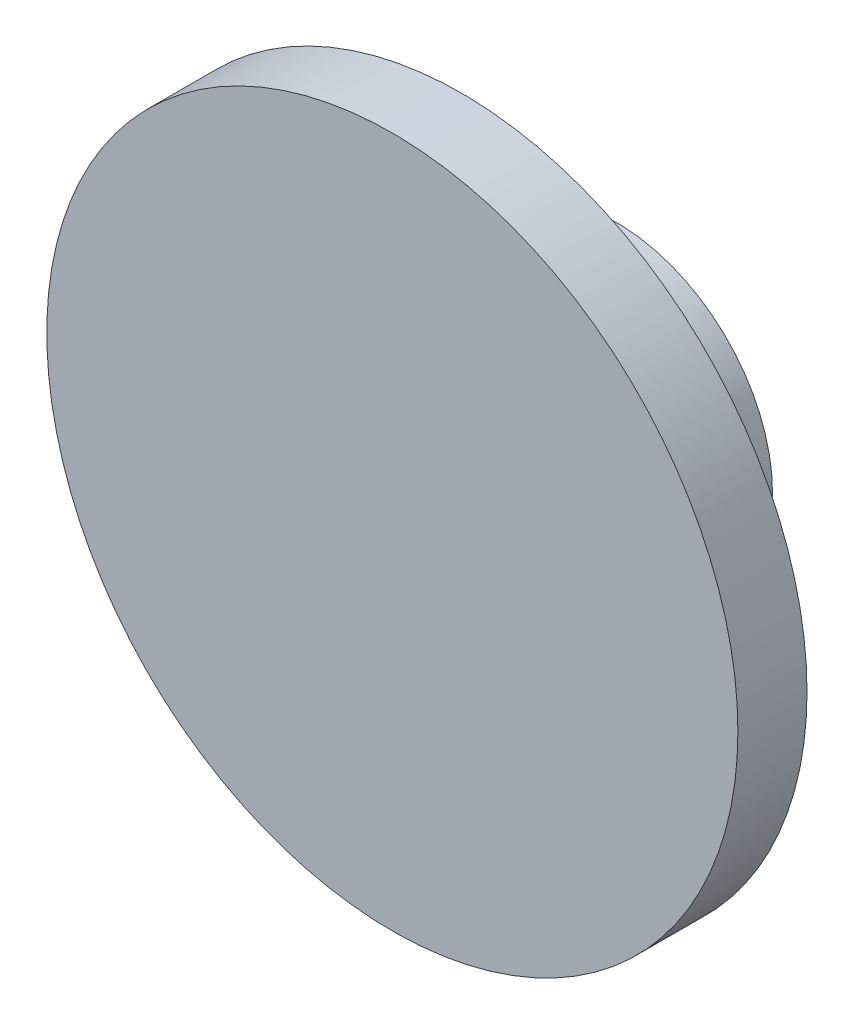
ISO-10303-21;
HEADER;
FILE_DESCRIPTION(('STEP AP214'),'2;1');
FILE_NAME('part.step','',(''),(''),'','','');
FILE_SCHEMA(('AUTOMOTIVE_DESIGN { 1 0 10303 214 1 1 1 1 }'));
ENDSEC;
DATA;
#1=APPLICATION_CONTEXT('core data for automotive mechanical design processes');
#2=APPLICATION_PROTOCOL_DEFINITION('international standard','automotive_design',2000,#1);
#3=PRODUCT_CONTEXT('',#1,'mechanical');
#4=PRODUCT('Part','Part','',(#3));
#5=PRODUCT_RELATED_PRODUCT_CATEGORY('part','',(#4));
#6=PRODUCT_DEFINITION_FORMATION('','',#4);
#7=PRODUCT_DEFINITION_CONTEXT('part definition',#1,'design');
#8=PRODUCT_DEFINITION('design','',#6,#7);
#9=PRODUCT_DEFINITION_SHAPE('','',#8);
#10=(LENGTH_UNIT() NAMED_UNIT(*) SI_UNIT(.MILLI.,.METRE.));
#11=(NAMED_UNIT(*) PLANE_ANGLE_UNIT() SI_UNIT($,.RADIAN.));
#12=(NAMED_UNIT(*) SI_UNIT($,.STERADIAN.) SOLID_ANGLE_UNIT());
#13=UNCERTAINTY_MEASURE_WITH_UNIT(LENGTH_MEASURE(1.E-05),#10,'distance_accuracy_value','');
#14=(GEOMETRIC_REPRESENTATION_CONTEXT(3) GLOBAL_UNCERTAINTY_ASSIGNED_CONTEXT((#13)) GLOBAL_UNIT_ASSIGNED_CONTEXT((#10,
#11,#12)) REPRESENTATION_CONTEXT('',''));
#15=CARTESIAN_POINT('',(0.,0.,0.));
#16=DIRECTION('',(0.,0.,1.));
#17=DIRECTION('',(1.,0.,0.));
#18=AXIS2_PLACEMENT_3D('',#15,#16,#17);
#19=CARTESIAN_POINT('',(0.,0.,0.));
#20=DIRECTION('',(0.,0.,1.));
#21=DIRECTION('',(1.,0.,0.));
#22=AXIS2_PLACEMENT_3D('',#19,#20,#21);
#23=PLANE('',#22);
#24=CARTESIAN_POINT('',(0.,0.,0.));
#25=DIRECTION('',(0.,0.,1.));
#26=DIRECTION('',(1.,0.,0.));
#27=AXIS2_PLACEMENT_3D('',#24,#25,#26);
#28=CIRCLE('',#27,4.5);
#29=CARTESIAN_POINT('',(4.5,0.,0.));
#30=VERTEX_POINT('',#29);
#31=EDGE_CURVE('E35',#30,#30,#28,.T.);
#32=ORIENTED_EDGE('',*,*,#31,.F.);
#33=EDGE_LOOP('',(#32));
#34=FACE_BOUND('',#33,.T.);
#35=CARTESIAN_POINT('',(0.,0.,0.));
#36=DIRECTION('',(0.,0.,1.));
#37=DIRECTION('',(1.,0.,0.));
#38=AXIS2_PLACEMENT_3D('',#35,#36,#37);
#39=CIRCLE('',#38,3.75);
#40=CARTESIAN_POINT('',(3.75,0.,0.));
#41=VERTEX_POINT('',#40);
#42=EDGE_CURVE('E42',#41,#41,#39,.T.);
#43=ORIENTED_EDGE('',*,*,#42,.T.);
#44=EDGE_LOOP('',(#43));
#45=FACE_BOUND('',#44,.T.);
#46=ADVANCED_FACE('F31',(#34,#45),#23,.F.);
#47=CARTESIAN_POINT('',(0.,0.,4.5));
#48=DIRECTION('',(0.,0.,-1.));
#49=DIRECTION('',(-1.,0.,0.));
#50=AXIS2_PLACEMENT_3D('',#47,#48,#49);
#51=CYLINDRICAL_SURFACE('',#50,4.5);
#52=CARTESIAN_POINT('',(0.,0.,4.5));
#53=DIRECTION('',(0.,0.,1.));
#54=DIRECTION('',(1.,0.,0.));
#55=AXIS2_PLACEMENT_3D('',#52,#53,#54);
#56=CIRCLE('',#55,4.5);
#57=CARTESIAN_POINT('',(4.5,0.,4.5));
#58=VERTEX_POINT('',#57);
#59=EDGE_CURVE('E10',#58,#58,#56,.T.);
#60=ORIENTED_EDGE('',*,*,#59,.F.);
#61=EDGE_LOOP('',(#60));
#62=FACE_BOUND('',#61,.T.);
#63=ORIENTED_EDGE('',*,*,#31,.T.);
#64=EDGE_LOOP('',(#63));
#65=FACE_BOUND('',#64,.T.);
#66=ADVANCED_FACE('F33',(#62,#65),#51,.T.);
#67=CARTESIAN_POINT('',(0.,0.,4.5));
#68=DIRECTION('',(0.,0.,-1.));
#69=DIRECTION('',(-1.,0.,0.));
#70=AXIS2_PLACEMENT_3D('',#67,#68,#69);
#71=CYLINDRICAL_SURFACE('',#70,3.75);
#72=CARTESIAN_POINT('',(0.,0.,4.5));
#73=DIRECTION('',(0.,0.,1.));
#74=DIRECTION('',(1.,0.,0.));
#75=AXIS2_PLACEMENT_3D('',#72,#73,#74);
#76=CIRCLE('',#75,3.75);
#77=CARTESIAN_POINT('',(3.75,0.,4.5));
#78=VERTEX_POINT('',#77);
#79=EDGE_CURVE('E46',#78,#78,#76,.T.);
#80=ORIENTED_EDGE('',*,*,#79,.T.);
#81=EDGE_LOOP('',(#80));
#82=FACE_BOUND('',#81,.T.);
#83=ORIENTED_EDGE('',*,*,#42,.F.);
#84=EDGE_LOOP('',(#83));
#85=FACE_BOUND('',#84,.T.);
#86=ADVANCED_FACE('F73',(#82,#85),#71,.F.);
#87=CARTESIAN_POINT('',(0.,0.,4.5));
#88=DIRECTION('',(0.,0.,1.));
#89=DIRECTION('',(1.,0.,0.));
#90=AXIS2_PLACEMENT_3D('',#87,#88,#89);
#91=PLANE('',#90);
#92=ORIENTED_EDGE('',*,*,#79,.F.);
#93=EDGE_LOOP('',(#92));
#94=FACE_BOUND('',#93,.T.);
#95=ADVANCED_FACE('F61',(#94),#91,.F.);
#96=CARTESIAN_POINT('',(0.,0.,6.5));
#97=DIRECTION('',(0.,0.,-1.));
#98=DIRECTION('',(-1.,0.,0.));
#99=AXIS2_PLACEMENT_3D('',#96,#97,#98);
#100=CYLINDRICAL_SURFACE('',#99,10.);
#101=CARTESIAN_POINT('',(0.,0.,6.5));
#102=DIRECTION('',(0.,0.,1.));
#103=DIRECTION('',(1.,0.,0.));
#104=AXIS2_PLACEMENT_3D('',#101,#102,#103);
#105=CIRCLE('',#104,10.);
#106=CARTESIAN_POINT('',(10.,0.,6.5));
#107=VERTEX_POINT('',#106);
#108=EDGE_CURVE('E49',#107,#107,#105,.T.);
#109=ORIENTED_EDGE('',*,*,#108,.F.);
#110=EDGE_LOOP('',(#109));
#111=FACE_BOUND('',#110,.T.);
#112=CARTESIAN_POINT('',(0.,0.,4.5));
#113=DIRECTION('',(0.,0.,1.));
#114=DIRECTION('',(1.,0.,0.));
#115=AXIS2_PLACEMENT_3D('',#112,#113,#114);
#116=CIRCLE('',#115,10.);
#117=CARTESIAN_POINT('',(10.,0.,4.5));
#118=VERTEX_POINT('',#117);
#119=EDGE_CURVE('E50',#118,#118,#116,.T.);
#120=ORIENTED_EDGE('',*,*,#119,.T.);
#121=EDGE_LOOP('',(#120));
#122=FACE_BOUND('',#121,.T.);
#123=ADVANCED_FACE('F58',(#111,#122),#100,.T.);
#124=CARTESIAN_POINT('',(0.,0.,6.5));
#125=DIRECTION('',(0.,0.,1.));
#126=DIRECTION('',(1.,0.,0.));
#127=AXIS2_PLACEMENT_3D('',#124,#125,#126);
#128=PLANE('',#127);
#129=ORIENTED_EDGE('',*,*,#108,.T.);
#130=EDGE_LOOP('',(#129));
#131=FACE_BOUND('',#130,.T.);
#132=ADVANCED_FACE('F56',(#131),#128,.T.);
#133=ORIENTED_EDGE('',*,*,#59,.T.);
#134=EDGE_LOOP('',(#133));
#135=FACE_BOUND('',#134,.T.);
#136=ORIENTED_EDGE('',*,*,#119,.F.);
#137=EDGE_LOOP('',(#136));
#138=FACE_BOUND('',#137,.T.);
#139=ADVANCED_FACE('F65',(#135,#138),#91,.F.);
#140=CLOSED_SHELL('',(#46,#66,#86,#95,#123,#132,#139));
#141=MANIFOLD_SOLID_BREP('B2',#140);
#142=ADVANCED_BREP_SHAPE_REPRESENTATION('',(#18,#141),#14);
#143=SHAPE_DEFINITION_REPRESENTATION(#9,#142);
ENDSEC;
END-ISO-10303-21;
